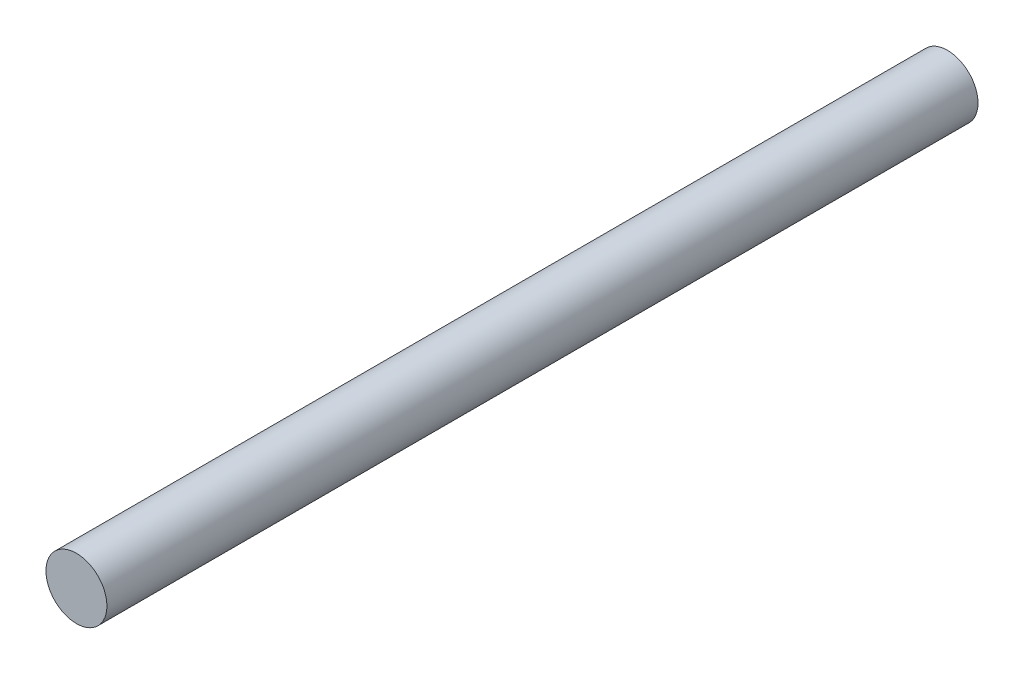
ISO-10303-21;
HEADER;
FILE_DESCRIPTION(('STEP AP214'),'2;1');
FILE_NAME('part.step','',(''),(''),'','','');
FILE_SCHEMA(('AUTOMOTIVE_DESIGN { 1 0 10303 214 1 1 1 1 }'));
ENDSEC;
DATA;
#1=APPLICATION_CONTEXT('core data for automotive mechanical design processes');
#2=APPLICATION_PROTOCOL_DEFINITION('international standard','automotive_design',2000,#1);
#3=PRODUCT_CONTEXT('',#1,'mechanical');
#4=PRODUCT('Part','Part','',(#3));
#5=PRODUCT_RELATED_PRODUCT_CATEGORY('part','',(#4));
#6=PRODUCT_DEFINITION_FORMATION('','',#4);
#7=PRODUCT_DEFINITION_CONTEXT('part definition',#1,'design');
#8=PRODUCT_DEFINITION('design','',#6,#7);
#9=PRODUCT_DEFINITION_SHAPE('','',#8);
#10=(LENGTH_UNIT() NAMED_UNIT(*) SI_UNIT(.MILLI.,.METRE.));
#11=(NAMED_UNIT(*) PLANE_ANGLE_UNIT() SI_UNIT($,.RADIAN.));
#12=(NAMED_UNIT(*) SI_UNIT($,.STERADIAN.) SOLID_ANGLE_UNIT());
#13=UNCERTAINTY_MEASURE_WITH_UNIT(LENGTH_MEASURE(1.E-05),#10,'distance_accuracy_value','');
#14=(GEOMETRIC_REPRESENTATION_CONTEXT(3) GLOBAL_UNCERTAINTY_ASSIGNED_CONTEXT((#13)) GLOBAL_UNIT_ASSIGNED_CONTEXT((#10,
#11,#12)) REPRESENTATION_CONTEXT('',''));
#15=CARTESIAN_POINT('',(0.,0.,0.));
#16=DIRECTION('',(0.,0.,1.));
#17=DIRECTION('',(1.,0.,0.));
#18=AXIS2_PLACEMENT_3D('',#15,#16,#17);
#19=CARTESIAN_POINT('',(0.,0.,40.));
#20=DIRECTION('',(0.,0.,-1.));
#21=DIRECTION('',(-1.,0.,0.));
#22=AXIS2_PLACEMENT_3D('',#19,#20,#21);
#23=CYLINDRICAL_SURFACE('',#22,1.4);
#24=CARTESIAN_POINT('',(0.,0.,40.));
#25=DIRECTION('',(0.,0.,1.));
#26=DIRECTION('',(1.,0.,0.));
#27=AXIS2_PLACEMENT_3D('',#24,#25,#26);
#28=CIRCLE('',#27,1.4);
#29=CARTESIAN_POINT('',(1.4,0.,40.));
#30=VERTEX_POINT('',#29);
#31=EDGE_CURVE('E10',#30,#30,#28,.T.);
#32=ORIENTED_EDGE('',*,*,#31,.F.);
#33=EDGE_LOOP('',(#32));
#34=FACE_BOUND('',#33,.T.);
#35=CARTESIAN_POINT('',(0.,0.,0.));
#36=DIRECTION('',(0.,0.,1.));
#37=DIRECTION('',(1.,0.,0.));
#38=AXIS2_PLACEMENT_3D('',#35,#36,#37);
#39=CIRCLE('',#38,1.4);
#40=CARTESIAN_POINT('',(1.4,0.,0.));
#41=VERTEX_POINT('',#40);
#42=EDGE_CURVE('E34',#41,#41,#39,.T.);
#43=ORIENTED_EDGE('',*,*,#42,.T.);
#44=EDGE_LOOP('',(#43));
#45=FACE_BOUND('',#44,.T.);
#46=ADVANCED_FACE('F31',(#34,#45),#23,.T.);
#47=CARTESIAN_POINT('',(0.,0.,40.));
#48=DIRECTION('',(0.,0.,1.));
#49=DIRECTION('',(1.,0.,0.));
#50=AXIS2_PLACEMENT_3D('',#47,#48,#49);
#51=PLANE('',#50);
#52=ORIENTED_EDGE('',*,*,#31,.T.);
#53=EDGE_LOOP('',(#52));
#54=FACE_BOUND('',#53,.T.);
#55=ADVANCED_FACE('F46',(#54),#51,.T.);
#56=CARTESIAN_POINT('',(0.,0.,0.));
#57=DIRECTION('',(0.,0.,1.));
#58=DIRECTION('',(1.,0.,0.));
#59=AXIS2_PLACEMENT_3D('',#56,#57,#58);
#60=PLANE('',#59);
#61=ORIENTED_EDGE('',*,*,#42,.F.);
#62=EDGE_LOOP('',(#61));
#63=FACE_BOUND('',#62,.T.);
#64=ADVANCED_FACE('F44',(#63),#60,.F.);
#65=CLOSED_SHELL('',(#46,#55,#64));
#66=MANIFOLD_SOLID_BREP('B2',#65);
#67=ADVANCED_BREP_SHAPE_REPRESENTATION('',(#18,#66),#14);
#68=SHAPE_DEFINITION_REPRESENTATION(#9,#67);
ENDSEC;
END-ISO-10303-21;
